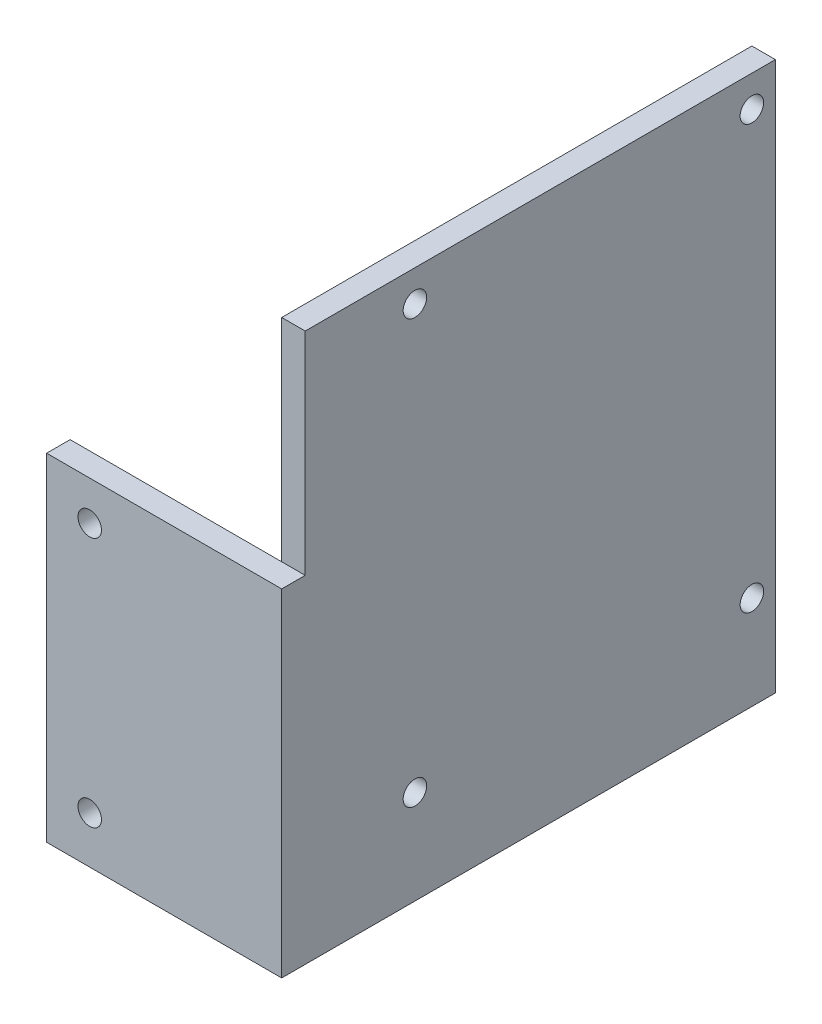
ISO-10303-21;
HEADER;
FILE_DESCRIPTION(('STEP AP214'),'2;1');
FILE_NAME('part.step','',(''),(''),'','','');
FILE_SCHEMA(('AUTOMOTIVE_DESIGN { 1 0 10303 214 1 1 1 1 }'));
ENDSEC;
DATA;
#1=APPLICATION_CONTEXT('core data for automotive mechanical design processes');
#2=APPLICATION_PROTOCOL_DEFINITION('international standard','automotive_design',2000,#1);
#3=PRODUCT_CONTEXT('',#1,'mechanical');
#4=PRODUCT('Part','Part','',(#3));
#5=PRODUCT_RELATED_PRODUCT_CATEGORY('part','',(#4));
#6=PRODUCT_DEFINITION_FORMATION('','',#4);
#7=PRODUCT_DEFINITION_CONTEXT('part definition',#1,'design');
#8=PRODUCT_DEFINITION('design','',#6,#7);
#9=PRODUCT_DEFINITION_SHAPE('','',#8);
#10=(LENGTH_UNIT() NAMED_UNIT(*) SI_UNIT(.MILLI.,.METRE.));
#11=(NAMED_UNIT(*) PLANE_ANGLE_UNIT() SI_UNIT($,.RADIAN.));
#12=(NAMED_UNIT(*) SI_UNIT($,.STERADIAN.) SOLID_ANGLE_UNIT());
#13=UNCERTAINTY_MEASURE_WITH_UNIT(LENGTH_MEASURE(1.E-05),#10,'distance_accuracy_value','');
#14=(GEOMETRIC_REPRESENTATION_CONTEXT(3) GLOBAL_UNCERTAINTY_ASSIGNED_CONTEXT((#13)) GLOBAL_UNIT_ASSIGNED_CONTEXT((#10,
#11,#12)) REPRESENTATION_CONTEXT('',''));
#15=CARTESIAN_POINT('',(0.,0.,0.));
#16=DIRECTION('',(0.,0.,1.));
#17=DIRECTION('',(1.,0.,0.));
#18=AXIS2_PLACEMENT_3D('',#15,#16,#17);
#19=CARTESIAN_POINT('',(0.,0.,3.));
#20=DIRECTION('',(0.,0.,1.));
#21=DIRECTION('',(1.,0.,0.));
#22=AXIS2_PLACEMENT_3D('',#19,#20,#21);
#23=PLANE('',#22);
#24=CARTESIAN_POINT('',(-34.8786307637416,11.4678391828182,3.));
#25=DIRECTION('',(0.,0.,1.));
#26=DIRECTION('',(1.,0.,0.));
#27=AXIS2_PLACEMENT_3D('',#24,#25,#26);
#28=CIRCLE('',#27,1.5);
#29=CARTESIAN_POINT('',(-33.3786307637416,11.4678391828182,3.));
#30=VERTEX_POINT('',#29);
#31=EDGE_CURVE('E147',#30,#30,#28,.T.);
#32=ORIENTED_EDGE('',*,*,#31,.F.);
#33=EDGE_LOOP('',(#32));
#34=FACE_BOUND('',#33,.T.);
#35=DIRECTION('',(0.,-1.,0.));
#36=VECTOR('',#35,1.);
#37=CARTESIAN_POINT('',(-40.3786307637416,16.4678391828182,3.));
#38=LINE('',#37,#36);
#39=CARTESIAN_POINT('',(-40.3786307637416,16.4678391828182,3.));
#40=VERTEX_POINT('',#39);
#41=CARTESIAN_POINT('',(-40.3786307637416,-26.5321608171818,3.));
#42=VERTEX_POINT('',#41);
#43=EDGE_CURVE('E153',#40,#42,#38,.T.);
#44=ORIENTED_EDGE('',*,*,#43,.T.);
#45=DIRECTION('',(1.,0.,0.));
#46=VECTOR('',#45,1.);
#47=CARTESIAN_POINT('',(-40.3786307637416,-26.5321608171818,3.));
#48=LINE('',#47,#46);
#49=CARTESIAN_POINT('',(-10.3786307637416,-26.5321608171818,3.));
#50=VERTEX_POINT('',#49);
#51=EDGE_CURVE('E81',#42,#50,#48,.T.);
#52=ORIENTED_EDGE('',*,*,#51,.T.);
#53=DIRECTION('',(0.,1.,0.));
#54=VECTOR('',#53,1.);
#55=CARTESIAN_POINT('',(-10.3786307637416,16.4678391828182,3.));
#56=LINE('',#55,#54);
#57=CARTESIAN_POINT('',(-10.3786307637416,16.4678391828182,3.));
#58=VERTEX_POINT('',#57);
#59=EDGE_CURVE('E157',#50,#58,#56,.T.);
#60=ORIENTED_EDGE('',*,*,#59,.T.);
#61=DIRECTION('',(-1.,0.,0.));
#62=VECTOR('',#61,1.);
#63=CARTESIAN_POINT('',(-40.3786307637416,16.4678391828182,3.));
#64=LINE('',#63,#62);
#65=EDGE_CURVE('E58',#58,#40,#64,.T.);
#66=ORIENTED_EDGE('',*,*,#65,.T.);
#67=EDGE_LOOP('',(#44,#52,#60,#66));
#68=FACE_BOUND('',#67,.T.);
#69=CARTESIAN_POINT('',(-34.8786307637416,-20.5321608171818,3.));
#70=DIRECTION('',(0.,0.,1.));
#71=DIRECTION('',(1.,0.,0.));
#72=AXIS2_PLACEMENT_3D('',#69,#70,#71);
#73=CIRCLE('',#72,1.5);
#74=CARTESIAN_POINT('',(-33.3786307637416,-20.5321608171818,3.));
#75=VERTEX_POINT('',#74);
#76=EDGE_CURVE('E141',#75,#75,#73,.T.);
#77=ORIENTED_EDGE('',*,*,#76,.F.);
#78=EDGE_LOOP('',(#77));
#79=FACE_BOUND('',#78,.T.);
#80=ADVANCED_FACE('F33',(#34,#68,#79),#23,.T.);
#81=CARTESIAN_POINT('',(0.,0.,0.));
#82=DIRECTION('',(0.,0.,1.));
#83=DIRECTION('',(1.,0.,0.));
#84=AXIS2_PLACEMENT_3D('',#81,#82,#83);
#85=PLANE('',#84);
#86=DIRECTION('',(-1.,0.,0.));
#87=VECTOR('',#86,1.);
#88=CARTESIAN_POINT('',(-40.3786307637416,16.4678391828182,0.));
#89=LINE('',#88,#87);
#90=CARTESIAN_POINT('',(-13.3786307637416,16.4678391828182,0.));
#91=VERTEX_POINT('',#90);
#92=CARTESIAN_POINT('',(-40.3786307637416,16.4678391828182,0.));
#93=VERTEX_POINT('',#92);
#94=EDGE_CURVE('E73',#91,#93,#89,.T.);
#95=ORIENTED_EDGE('',*,*,#94,.F.);
#96=DIRECTION('',(0.,-1.,0.));
#97=VECTOR('',#96,1.);
#98=CARTESIAN_POINT('',(-13.3786307637416,-26.5321608171818,0.));
#99=LINE('',#98,#97);
#100=CARTESIAN_POINT('',(-13.3786307637416,-26.5321608171818,0.));
#101=VERTEX_POINT('',#100);
#102=EDGE_CURVE('E11',#91,#101,#99,.T.);
#103=ORIENTED_EDGE('',*,*,#102,.T.);
#104=DIRECTION('',(1.,0.,0.));
#105=VECTOR('',#104,1.);
#106=CARTESIAN_POINT('',(-40.3786307637416,-26.5321608171818,0.));
#107=LINE('',#106,#105);
#108=CARTESIAN_POINT('',(-40.3786307637416,-26.5321608171818,0.));
#109=VERTEX_POINT('',#108);
#110=EDGE_CURVE('E123',#109,#101,#107,.T.);
#111=ORIENTED_EDGE('',*,*,#110,.F.);
#112=DIRECTION('',(0.,-1.,0.));
#113=VECTOR('',#112,1.);
#114=CARTESIAN_POINT('',(-40.3786307637416,16.4678391828182,0.));
#115=LINE('',#114,#113);
#116=EDGE_CURVE('E150',#93,#109,#115,.T.);
#117=ORIENTED_EDGE('',*,*,#116,.F.);
#118=EDGE_LOOP('',(#95,#103,#111,#117));
#119=FACE_BOUND('',#118,.T.);
#120=CARTESIAN_POINT('',(-34.8786307637416,11.4678391828182,0.));
#121=DIRECTION('',(0.,0.,1.));
#122=DIRECTION('',(1.,0.,0.));
#123=AXIS2_PLACEMENT_3D('',#120,#121,#122);
#124=CIRCLE('',#123,1.5);
#125=CARTESIAN_POINT('',(-33.3786307637416,11.4678391828182,0.));
#126=VERTEX_POINT('',#125);
#127=EDGE_CURVE('E144',#126,#126,#124,.T.);
#128=ORIENTED_EDGE('',*,*,#127,.T.);
#129=EDGE_LOOP('',(#128));
#130=FACE_BOUND('',#129,.T.);
#131=CARTESIAN_POINT('',(-34.8786307637416,-20.5321608171818,0.));
#132=DIRECTION('',(0.,0.,1.));
#133=DIRECTION('',(1.,0.,0.));
#134=AXIS2_PLACEMENT_3D('',#131,#132,#133);
#135=CIRCLE('',#134,1.5);
#136=CARTESIAN_POINT('',(-33.3786307637416,-20.5321608171818,0.));
#137=VERTEX_POINT('',#136);
#138=EDGE_CURVE('E139',#137,#137,#135,.T.);
#139=ORIENTED_EDGE('',*,*,#138,.T.);
#140=EDGE_LOOP('',(#139));
#141=FACE_BOUND('',#140,.T.);
#142=ADVANCED_FACE('F176',(#119,#130,#141),#85,.F.);
#143=CARTESIAN_POINT('',(-40.3786307637416,16.4678391828182,3.));
#144=DIRECTION('',(1.,0.,0.));
#145=DIRECTION('',(0.,1.,0.));
#146=AXIS2_PLACEMENT_3D('',#143,#144,#145);
#147=PLANE('',#146);
#148=ORIENTED_EDGE('',*,*,#116,.T.);
#149=DIRECTION('',(0.,0.,-1.));
#150=VECTOR('',#149,1.);
#151=CARTESIAN_POINT('',(-40.3786307637416,-26.5321608171818,3.));
#152=LINE('',#151,#150);
#153=EDGE_CURVE('E37',#42,#109,#152,.T.);
#154=ORIENTED_EDGE('',*,*,#153,.F.);
#155=ORIENTED_EDGE('',*,*,#43,.F.);
#156=DIRECTION('',(0.,0.,-1.));
#157=VECTOR('',#156,1.);
#158=CARTESIAN_POINT('',(-40.3786307637416,16.4678391828182,3.));
#159=LINE('',#158,#157);
#160=EDGE_CURVE('E160',#40,#93,#159,.T.);
#161=ORIENTED_EDGE('',*,*,#160,.T.);
#162=EDGE_LOOP('',(#148,#154,#155,#161));
#163=FACE_BOUND('',#162,.T.);
#164=ADVANCED_FACE('F35',(#163),#147,.F.);
#165=CARTESIAN_POINT('',(-40.3786307637416,-26.5321608171818,3.));
#166=DIRECTION('',(0.,1.,0.));
#167=DIRECTION('',(0.,0.,1.));
#168=AXIS2_PLACEMENT_3D('',#165,#166,#167);
#169=PLANE('',#168);
#170=ORIENTED_EDGE('',*,*,#110,.T.);
#171=DIRECTION('',(0.,0.,-1.));
#172=VECTOR('',#171,1.);
#173=CARTESIAN_POINT('',(-13.3786307637416,-26.5321608171818,0.));
#174=LINE('',#173,#172);
#175=CARTESIAN_POINT('',(-13.3786307637416,-26.5321608171818,-60.));
#176=VERTEX_POINT('',#175);
#177=EDGE_CURVE('E50',#101,#176,#174,.T.);
#178=ORIENTED_EDGE('',*,*,#177,.T.);
#179=DIRECTION('',(1.,0.,0.));
#180=VECTOR('',#179,1.);
#181=CARTESIAN_POINT('',(-13.3786307637416,-26.5321608171818,-60.));
#182=LINE('',#181,#180);
#183=CARTESIAN_POINT('',(-10.3786307637416,-26.5321608171818,-60.));
#184=VERTEX_POINT('',#183);
#185=EDGE_CURVE('E108',#176,#184,#182,.T.);
#186=ORIENTED_EDGE('',*,*,#185,.T.);
#187=DIRECTION('',(0.,0.,-1.));
#188=VECTOR('',#187,1.);
#189=CARTESIAN_POINT('',(-10.3786307637416,-26.5321608171818,3.));
#190=LINE('',#189,#188);
#191=EDGE_CURVE('E168',#50,#184,#190,.T.);
#192=ORIENTED_EDGE('',*,*,#191,.F.);
#193=ORIENTED_EDGE('',*,*,#51,.F.);
#194=ORIENTED_EDGE('',*,*,#153,.T.);
#195=EDGE_LOOP('',(#170,#178,#186,#192,#193,#194));
#196=FACE_BOUND('',#195,.T.);
#197=ADVANCED_FACE('F122',(#196),#169,.F.);
#198=CARTESIAN_POINT('',(-10.3786307637416,16.4678391828182,3.));
#199=DIRECTION('',(-1.,0.,0.));
#200=DIRECTION('',(0.,-1.,0.));
#201=AXIS2_PLACEMENT_3D('',#198,#199,#200);
#202=PLANE('',#201);
#203=ORIENTED_EDGE('',*,*,#191,.T.);
#204=DIRECTION('',(0.,1.,0.));
#205=VECTOR('',#204,1.);
#206=CARTESIAN_POINT('',(-10.3786307637416,-26.5321608171818,-60.));
#207=LINE('',#206,#205);
#208=CARTESIAN_POINT('',(-10.3786307637416,43.4678391828182,-60.));
#209=VERTEX_POINT('',#208);
#210=EDGE_CURVE('E113',#184,#209,#207,.T.);
#211=ORIENTED_EDGE('',*,*,#210,.T.);
#212=DIRECTION('',(0.,0.,1.));
#213=VECTOR('',#212,1.);
#214=CARTESIAN_POINT('',(-10.3786307637416,43.4678391828182,0.));
#215=LINE('',#214,#213);
#216=CARTESIAN_POINT('',(-10.3786307637416,43.4678391828182,0.));
#217=VERTEX_POINT('',#216);
#218=EDGE_CURVE('E126',#209,#217,#215,.T.);
#219=ORIENTED_EDGE('',*,*,#218,.T.);
#220=DIRECTION('',(0.,-1.,0.));
#221=VECTOR('',#220,1.);
#222=CARTESIAN_POINT('',(-10.3786307637416,-26.5321608171818,0.));
#223=LINE('',#222,#221);
#224=CARTESIAN_POINT('',(-10.3786307637416,16.4678391828182,0.));
#225=VERTEX_POINT('',#224);
#226=EDGE_CURVE('E130',#217,#225,#223,.T.);
#227=ORIENTED_EDGE('',*,*,#226,.T.);
#228=DIRECTION('',(0.,0.,-1.));
#229=VECTOR('',#228,1.);
#230=CARTESIAN_POINT('',(-10.3786307637416,16.4678391828182,3.));
#231=LINE('',#230,#229);
#232=EDGE_CURVE('E166',#58,#225,#231,.T.);
#233=ORIENTED_EDGE('',*,*,#232,.F.);
#234=ORIENTED_EDGE('',*,*,#59,.F.);
#235=EDGE_LOOP('',(#203,#211,#219,#227,#233,#234));
#236=FACE_BOUND('',#235,.T.);
#237=CARTESIAN_POINT('',(-10.3786307637416,-14.5321608171817,-57.0000000000006));
#238=DIRECTION('',(1.,0.,0.));
#239=DIRECTION('',(0.,1.,0.));
#240=AXIS2_PLACEMENT_3D('',#237,#238,#239);
#241=CIRCLE('',#240,1.5);
#242=CARTESIAN_POINT('',(-10.3786307637416,-13.0321608171817,-57.0000000000006));
#243=VERTEX_POINT('',#242);
#244=EDGE_CURVE('E345',#243,#243,#241,.T.);
#245=ORIENTED_EDGE('',*,*,#244,.F.);
#246=EDGE_LOOP('',(#245));
#247=FACE_BOUND('',#246,.T.);
#248=CARTESIAN_POINT('',(-10.3786307637416,-14.532160817182,-14.0000000000006));
#249=DIRECTION('',(1.,0.,0.));
#250=DIRECTION('',(0.,1.,0.));
#251=AXIS2_PLACEMENT_3D('',#248,#249,#250);
#252=CIRCLE('',#251,1.5);
#253=CARTESIAN_POINT('',(-10.3786307637416,-13.032160817182,-14.0000000000006));
#254=VERTEX_POINT('',#253);
#255=EDGE_CURVE('E347',#254,#254,#252,.T.);
#256=ORIENTED_EDGE('',*,*,#255,.F.);
#257=EDGE_LOOP('',(#256));
#258=FACE_BOUND('',#257,.T.);
#259=CARTESIAN_POINT('',(-10.3786307637416,39.467839182818,-14.));
#260=DIRECTION('',(1.,0.,0.));
#261=DIRECTION('',(0.,1.,0.));
#262=AXIS2_PLACEMENT_3D('',#259,#260,#261);
#263=CIRCLE('',#262,1.5);
#264=CARTESIAN_POINT('',(-10.3786307637416,40.967839182818,-14.));
#265=VERTEX_POINT('',#264);
#266=EDGE_CURVE('E353',#265,#265,#263,.T.);
#267=ORIENTED_EDGE('',*,*,#266,.F.);
#268=EDGE_LOOP('',(#267));
#269=FACE_BOUND('',#268,.T.);
#270=CARTESIAN_POINT('',(-10.3786307637416,39.4678391828183,-57.));
#271=DIRECTION('',(1.,0.,0.));
#272=DIRECTION('',(0.,1.,0.));
#273=AXIS2_PLACEMENT_3D('',#270,#271,#272);
#274=CIRCLE('',#273,1.5);
#275=CARTESIAN_POINT('',(-10.3786307637416,40.9678391828183,-57.));
#276=VERTEX_POINT('',#275);
#277=EDGE_CURVE('E359',#276,#276,#274,.T.);
#278=ORIENTED_EDGE('',*,*,#277,.F.);
#279=EDGE_LOOP('',(#278));
#280=FACE_BOUND('',#279,.T.);
#281=ADVANCED_FACE('F184',(#236,#247,#258,#269,#280),#202,.F.);
#282=CARTESIAN_POINT('',(-40.3786307637416,16.4678391828182,3.));
#283=DIRECTION('',(0.,-1.,0.));
#284=DIRECTION('',(0.,0.,-1.));
#285=AXIS2_PLACEMENT_3D('',#282,#283,#284);
#286=PLANE('',#285);
#287=EDGE_CURVE('E155',#225,#91,#89,.T.);
#288=ORIENTED_EDGE('',*,*,#287,.T.);
#289=ORIENTED_EDGE('',*,*,#94,.T.);
#290=ORIENTED_EDGE('',*,*,#160,.F.);
#291=ORIENTED_EDGE('',*,*,#65,.F.);
#292=ORIENTED_EDGE('',*,*,#232,.T.);
#293=EDGE_LOOP('',(#288,#289,#290,#291,#292));
#294=FACE_BOUND('',#293,.T.);
#295=ADVANCED_FACE('F187',(#294),#286,.F.);
#296=CARTESIAN_POINT('',(-34.8786307637416,11.4678391828182,3.));
#297=DIRECTION('',(0.,0.,-1.));
#298=DIRECTION('',(-1.,0.,0.));
#299=AXIS2_PLACEMENT_3D('',#296,#297,#298);
#300=CYLINDRICAL_SURFACE('',#299,1.5);
#301=ORIENTED_EDGE('',*,*,#31,.T.);
#302=EDGE_LOOP('',(#301));
#303=FACE_BOUND('',#302,.T.);
#304=ORIENTED_EDGE('',*,*,#127,.F.);
#305=EDGE_LOOP('',(#304));
#306=FACE_BOUND('',#305,.T.);
#307=ADVANCED_FACE('F197',(#303,#306),#300,.F.);
#308=CARTESIAN_POINT('',(-34.8786307637416,-20.5321608171818,3.));
#309=DIRECTION('',(0.,0.,-1.));
#310=DIRECTION('',(-1.,0.,0.));
#311=AXIS2_PLACEMENT_3D('',#308,#309,#310);
#312=CYLINDRICAL_SURFACE('',#311,1.5);
#313=ORIENTED_EDGE('',*,*,#76,.T.);
#314=EDGE_LOOP('',(#313));
#315=FACE_BOUND('',#314,.T.);
#316=ORIENTED_EDGE('',*,*,#138,.F.);
#317=EDGE_LOOP('',(#316));
#318=FACE_BOUND('',#317,.T.);
#319=ADVANCED_FACE('F194',(#315,#318),#312,.F.);
#320=CARTESIAN_POINT('',(-13.3786307637416,-26.5321608171818,0.));
#321=DIRECTION('',(0.,0.,1.));
#322=DIRECTION('',(1.,0.,0.));
#323=AXIS2_PLACEMENT_3D('',#320,#321,#322);
#324=PLANE('',#323);
#325=ORIENTED_EDGE('',*,*,#287,.F.);
#326=ORIENTED_EDGE('',*,*,#226,.F.);
#327=DIRECTION('',(1.,0.,0.));
#328=VECTOR('',#327,1.);
#329=CARTESIAN_POINT('',(-13.3786307637416,43.4678391828182,0.));
#330=LINE('',#329,#328);
#331=CARTESIAN_POINT('',(-13.3786307637416,43.4678391828182,0.));
#332=VERTEX_POINT('',#331);
#333=EDGE_CURVE('E137',#332,#217,#330,.T.);
#334=ORIENTED_EDGE('',*,*,#333,.F.);
#335=EDGE_CURVE('E43',#332,#91,#99,.T.);
#336=ORIENTED_EDGE('',*,*,#335,.T.);
#337=EDGE_LOOP('',(#325,#326,#334,#336));
#338=FACE_BOUND('',#337,.T.);
#339=ADVANCED_FACE('F179',(#338),#324,.T.);
#340=CARTESIAN_POINT('',(-13.3786307637416,43.4678391828182,0.));
#341=DIRECTION('',(0.,1.,0.));
#342=DIRECTION('',(-1.,0.,0.));
#343=AXIS2_PLACEMENT_3D('',#340,#341,#342);
#344=PLANE('',#343);
#345=ORIENTED_EDGE('',*,*,#218,.F.);
#346=DIRECTION('',(1.,0.,0.));
#347=VECTOR('',#346,1.);
#348=CARTESIAN_POINT('',(-13.3786307637416,43.4678391828182,-60.));
#349=LINE('',#348,#347);
#350=CARTESIAN_POINT('',(-13.3786307637416,43.4678391828182,-60.));
#351=VERTEX_POINT('',#350);
#352=EDGE_CURVE('E114',#351,#209,#349,.T.);
#353=ORIENTED_EDGE('',*,*,#352,.F.);
#354=DIRECTION('',(0.,0.,1.));
#355=VECTOR('',#354,1.);
#356=CARTESIAN_POINT('',(-13.3786307637416,43.4678391828182,0.));
#357=LINE('',#356,#355);
#358=EDGE_CURVE('E115',#351,#332,#357,.T.);
#359=ORIENTED_EDGE('',*,*,#358,.T.);
#360=ORIENTED_EDGE('',*,*,#333,.T.);
#361=EDGE_LOOP('',(#345,#353,#359,#360));
#362=FACE_BOUND('',#361,.T.);
#363=ADVANCED_FACE('F183',(#362),#344,.T.);
#364=CARTESIAN_POINT('',(-13.3786307637416,-26.5321608171818,-60.));
#365=DIRECTION('',(0.,0.,-1.));
#366=DIRECTION('',(-1.,0.,0.));
#367=AXIS2_PLACEMENT_3D('',#364,#365,#366);
#368=PLANE('',#367);
#369=ORIENTED_EDGE('',*,*,#210,.F.);
#370=ORIENTED_EDGE('',*,*,#185,.F.);
#371=DIRECTION('',(0.,1.,0.));
#372=VECTOR('',#371,1.);
#373=CARTESIAN_POINT('',(-13.3786307637416,-26.5321608171818,-60.));
#374=LINE('',#373,#372);
#375=EDGE_CURVE('E110',#176,#351,#374,.T.);
#376=ORIENTED_EDGE('',*,*,#375,.T.);
#377=ORIENTED_EDGE('',*,*,#352,.T.);
#378=EDGE_LOOP('',(#369,#370,#376,#377));
#379=FACE_BOUND('',#378,.T.);
#380=ADVANCED_FACE('F109',(#379),#368,.T.);
#381=CARTESIAN_POINT('',(-13.3786307637416,0.,0.));
#382=DIRECTION('',(-1.,0.,0.));
#383=DIRECTION('',(0.,-1.,0.));
#384=AXIS2_PLACEMENT_3D('',#381,#382,#383);
#385=PLANE('',#384);
#386=CARTESIAN_POINT('',(-13.3786307637416,-14.5321608171817,-57.0000000000006));
#387=DIRECTION('',(1.,0.,0.));
#388=DIRECTION('',(0.,1.,0.));
#389=AXIS2_PLACEMENT_3D('',#386,#387,#388);
#390=CIRCLE('',#389,1.5);
#391=CARTESIAN_POINT('',(-13.3786307637416,-13.0321608171817,-57.0000000000006));
#392=VERTEX_POINT('',#391);
#393=EDGE_CURVE('E342',#392,#392,#390,.T.);
#394=ORIENTED_EDGE('',*,*,#393,.T.);
#395=EDGE_LOOP('',(#394));
#396=FACE_BOUND('',#395,.T.);
#397=CARTESIAN_POINT('',(-13.3786307637416,-14.532160817182,-14.0000000000006));
#398=DIRECTION('',(1.,0.,0.));
#399=DIRECTION('',(0.,1.,0.));
#400=AXIS2_PLACEMENT_3D('',#397,#398,#399);
#401=CIRCLE('',#400,1.5);
#402=CARTESIAN_POINT('',(-13.3786307637416,-13.032160817182,-14.0000000000006));
#403=VERTEX_POINT('',#402);
#404=EDGE_CURVE('E350',#403,#403,#401,.T.);
#405=ORIENTED_EDGE('',*,*,#404,.T.);
#406=EDGE_LOOP('',(#405));
#407=FACE_BOUND('',#406,.T.);
#408=CARTESIAN_POINT('',(-13.3786307637416,39.467839182818,-14.));
#409=DIRECTION('',(1.,0.,0.));
#410=DIRECTION('',(0.,1.,0.));
#411=AXIS2_PLACEMENT_3D('',#408,#409,#410);
#412=CIRCLE('',#411,1.5);
#413=CARTESIAN_POINT('',(-13.3786307637416,40.967839182818,-14.));
#414=VERTEX_POINT('',#413);
#415=EDGE_CURVE('E356',#414,#414,#412,.T.);
#416=ORIENTED_EDGE('',*,*,#415,.T.);
#417=EDGE_LOOP('',(#416));
#418=FACE_BOUND('',#417,.T.);
#419=CARTESIAN_POINT('',(-13.3786307637416,39.4678391828183,-57.));
#420=DIRECTION('',(1.,0.,0.));
#421=DIRECTION('',(0.,1.,0.));
#422=AXIS2_PLACEMENT_3D('',#419,#420,#421);
#423=CIRCLE('',#422,1.5);
#424=CARTESIAN_POINT('',(-13.3786307637416,40.9678391828183,-57.));
#425=VERTEX_POINT('',#424);
#426=EDGE_CURVE('E133',#425,#425,#423,.T.);
#427=ORIENTED_EDGE('',*,*,#426,.T.);
#428=EDGE_LOOP('',(#427));
#429=FACE_BOUND('',#428,.T.);
#430=ORIENTED_EDGE('',*,*,#335,.F.);
#431=ORIENTED_EDGE('',*,*,#358,.F.);
#432=ORIENTED_EDGE('',*,*,#375,.F.);
#433=ORIENTED_EDGE('',*,*,#177,.F.);
#434=ORIENTED_EDGE('',*,*,#102,.F.);
#435=EDGE_LOOP('',(#430,#431,#432,#433,#434));
#436=FACE_BOUND('',#435,.T.);
#437=ADVANCED_FACE('F118',(#396,#407,#418,#429,#436),#385,.T.);
#438=CARTESIAN_POINT('',(-13.3786307637416,39.4678391828183,-57.));
#439=DIRECTION('',(1.,0.,0.));
#440=DIRECTION('',(0.,1.,0.));
#441=AXIS2_PLACEMENT_3D('',#438,#439,#440);
#442=CYLINDRICAL_SURFACE('',#441,1.5);
#443=ORIENTED_EDGE('',*,*,#426,.F.);
#444=EDGE_LOOP('',(#443));
#445=FACE_BOUND('',#444,.T.);
#446=ORIENTED_EDGE('',*,*,#277,.T.);
#447=EDGE_LOOP('',(#446));
#448=FACE_BOUND('',#447,.T.);
#449=ADVANCED_FACE('F258',(#445,#448),#442,.F.);
#450=CARTESIAN_POINT('',(-13.3786307637416,39.467839182818,-14.));
#451=DIRECTION('',(1.,0.,0.));
#452=DIRECTION('',(0.,1.,0.));
#453=AXIS2_PLACEMENT_3D('',#450,#451,#452);
#454=CYLINDRICAL_SURFACE('',#453,1.5);
#455=ORIENTED_EDGE('',*,*,#415,.F.);
#456=EDGE_LOOP('',(#455));
#457=FACE_BOUND('',#456,.T.);
#458=ORIENTED_EDGE('',*,*,#266,.T.);
#459=EDGE_LOOP('',(#458));
#460=FACE_BOUND('',#459,.T.);
#461=ADVANCED_FACE('F266',(#457,#460),#454,.F.);
#462=CARTESIAN_POINT('',(-13.3786307637416,-14.532160817182,-14.0000000000006));
#463=DIRECTION('',(1.,0.,0.));
#464=DIRECTION('',(0.,1.,0.));
#465=AXIS2_PLACEMENT_3D('',#462,#463,#464);
#466=CYLINDRICAL_SURFACE('',#465,1.5);
#467=ORIENTED_EDGE('',*,*,#404,.F.);
#468=EDGE_LOOP('',(#467));
#469=FACE_BOUND('',#468,.T.);
#470=ORIENTED_EDGE('',*,*,#255,.T.);
#471=EDGE_LOOP('',(#470));
#472=FACE_BOUND('',#471,.T.);
#473=ADVANCED_FACE('F274',(#469,#472),#466,.F.);
#474=CARTESIAN_POINT('',(-13.3786307637416,-14.5321608171817,-57.0000000000006));
#475=DIRECTION('',(1.,0.,0.));
#476=DIRECTION('',(0.,1.,0.));
#477=AXIS2_PLACEMENT_3D('',#474,#475,#476);
#478=CYLINDRICAL_SURFACE('',#477,1.5);
#479=ORIENTED_EDGE('',*,*,#393,.F.);
#480=EDGE_LOOP('',(#479));
#481=FACE_BOUND('',#480,.T.);
#482=ORIENTED_EDGE('',*,*,#244,.T.);
#483=EDGE_LOOP('',(#482));
#484=FACE_BOUND('',#483,.T.);
#485=ADVANCED_FACE('F282',(#481,#484),#478,.F.);
#486=CLOSED_SHELL('',(#80,#142,#164,#197,#281,#295,#307,#319,#339,#363,#380,#437,#449,#461,#473,#485));
#487=MANIFOLD_SOLID_BREP('B2',#486);
#488=ADVANCED_BREP_SHAPE_REPRESENTATION('',(#18,#487),#14);
#489=SHAPE_DEFINITION_REPRESENTATION(#9,#488);
ENDSEC;
END-ISO-10303-21;
